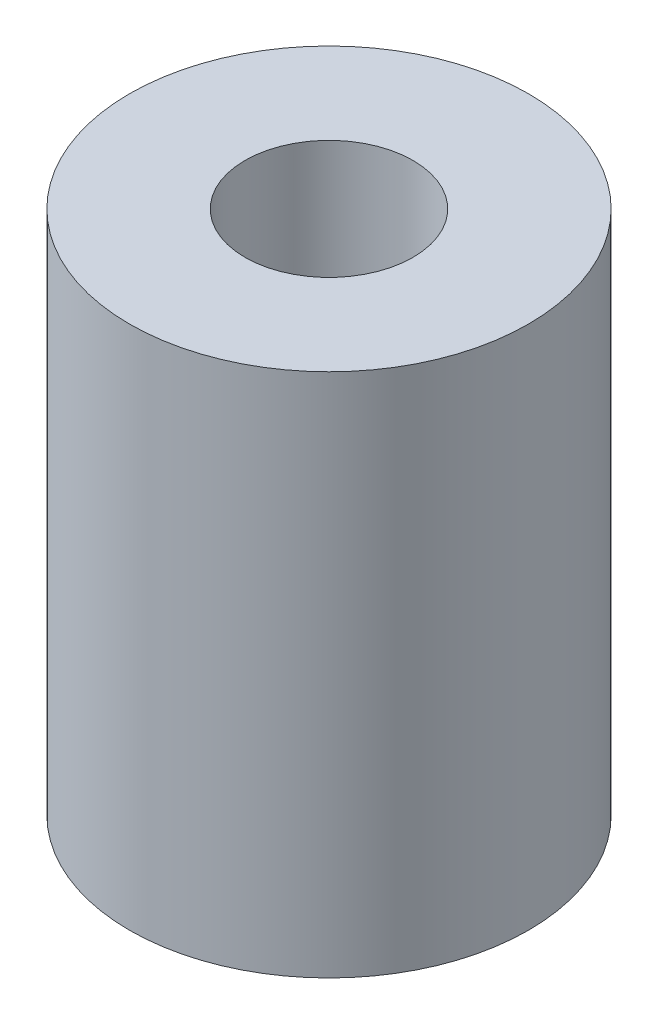
ISO-10303-21;
HEADER;
FILE_DESCRIPTION(('STEP AP214'),'2;1');
FILE_NAME('part.step','',(''),(''),'','','');
FILE_SCHEMA(('AUTOMOTIVE_DESIGN { 1 0 10303 214 1 1 1 1 }'));
ENDSEC;
DATA;
#1=APPLICATION_CONTEXT('core data for automotive mechanical design processes');
#2=APPLICATION_PROTOCOL_DEFINITION('international standard','automotive_design',2000,#1);
#3=PRODUCT_CONTEXT('',#1,'mechanical');
#4=PRODUCT('Part','Part','',(#3));
#5=PRODUCT_RELATED_PRODUCT_CATEGORY('part','',(#4));
#6=PRODUCT_DEFINITION_FORMATION('','',#4);
#7=PRODUCT_DEFINITION_CONTEXT('part definition',#1,'design');
#8=PRODUCT_DEFINITION('design','',#6,#7);
#9=PRODUCT_DEFINITION_SHAPE('','',#8);
#10=(LENGTH_UNIT() NAMED_UNIT(*) SI_UNIT(.MILLI.,.METRE.));
#11=(NAMED_UNIT(*) PLANE_ANGLE_UNIT() SI_UNIT($,.RADIAN.));
#12=(NAMED_UNIT(*) SI_UNIT($,.STERADIAN.) SOLID_ANGLE_UNIT());
#13=UNCERTAINTY_MEASURE_WITH_UNIT(LENGTH_MEASURE(1.E-05),#10,'distance_accuracy_value','');
#14=(GEOMETRIC_REPRESENTATION_CONTEXT(3) GLOBAL_UNCERTAINTY_ASSIGNED_CONTEXT((#13)) GLOBAL_UNIT_ASSIGNED_CONTEXT((#10,
#11,#12)) REPRESENTATION_CONTEXT('',''));
#15=CARTESIAN_POINT('',(0.,0.,0.));
#16=DIRECTION('',(0.,0.,1.));
#17=DIRECTION('',(1.,0.,0.));
#18=AXIS2_PLACEMENT_3D('',#15,#16,#17);
#19=CARTESIAN_POINT('',(0.,25.,0.));
#20=DIRECTION('',(0.,-1.,0.));
#21=DIRECTION('',(0.,0.,-1.));
#22=AXIS2_PLACEMENT_3D('',#19,#20,#21);
#23=CYLINDRICAL_SURFACE('',#22,9.5);
#24=CARTESIAN_POINT('',(0.,25.,0.));
#25=DIRECTION('',(0.,1.,0.));
#26=DIRECTION('',(0.,0.,1.));
#27=AXIS2_PLACEMENT_3D('',#24,#25,#26);
#28=CIRCLE('',#27,9.5);
#29=CARTESIAN_POINT('',(0.,25.,9.5));
#30=VERTEX_POINT('',#29);
#31=EDGE_CURVE('E10',#30,#30,#28,.T.);
#32=ORIENTED_EDGE('',*,*,#31,.F.);
#33=EDGE_LOOP('',(#32));
#34=FACE_BOUND('',#33,.T.);
#35=CARTESIAN_POINT('',(0.,0.,0.));
#36=DIRECTION('',(0.,1.,0.));
#37=DIRECTION('',(0.,0.,1.));
#38=AXIS2_PLACEMENT_3D('',#35,#36,#37);
#39=CIRCLE('',#38,9.5);
#40=CARTESIAN_POINT('',(0.,0.,9.5));
#41=VERTEX_POINT('',#40);
#42=EDGE_CURVE('E34',#41,#41,#39,.T.);
#43=ORIENTED_EDGE('',*,*,#42,.T.);
#44=EDGE_LOOP('',(#43));
#45=FACE_BOUND('',#44,.T.);
#46=ADVANCED_FACE('F31',(#34,#45),#23,.T.);
#47=CARTESIAN_POINT('',(0.,25.,0.));
#48=DIRECTION('',(0.,1.,0.));
#49=DIRECTION('',(0.,0.,1.));
#50=AXIS2_PLACEMENT_3D('',#47,#48,#49);
#51=PLANE('',#50);
#52=CARTESIAN_POINT('',(0.,25.,0.));
#53=DIRECTION('',(0.,1.,0.));
#54=DIRECTION('',(0.,0.,1.));
#55=AXIS2_PLACEMENT_3D('',#52,#53,#54);
#56=CIRCLE('',#55,4.);
#57=CARTESIAN_POINT('',(0.,25.,4.));
#58=VERTEX_POINT('',#57);
#59=EDGE_CURVE('E43',#58,#58,#56,.T.);
#60=ORIENTED_EDGE('',*,*,#59,.F.);
#61=EDGE_LOOP('',(#60));
#62=FACE_BOUND('',#61,.T.);
#63=ORIENTED_EDGE('',*,*,#31,.T.);
#64=EDGE_LOOP('',(#63));
#65=FACE_BOUND('',#64,.T.);
#66=ADVANCED_FACE('F68',(#62,#65),#51,.T.);
#67=CARTESIAN_POINT('',(0.,0.,0.));
#68=DIRECTION('',(0.,1.,0.));
#69=DIRECTION('',(0.,0.,1.));
#70=AXIS2_PLACEMENT_3D('',#67,#68,#69);
#71=PLANE('',#70);
#72=CARTESIAN_POINT('',(0.,0.,0.));
#73=DIRECTION('',(0.,-1.,0.));
#74=DIRECTION('',(0.,0.,-1.));
#75=AXIS2_PLACEMENT_3D('',#72,#73,#74);
#76=CIRCLE('',#75,2.5);
#77=CARTESIAN_POINT('',(0.,0.,-2.5));
#78=VERTEX_POINT('',#77);
#79=EDGE_CURVE('E49',#78,#78,#76,.T.);
#80=ORIENTED_EDGE('',*,*,#79,.F.);
#81=EDGE_LOOP('',(#80));
#82=FACE_BOUND('',#81,.T.);
#83=ORIENTED_EDGE('',*,*,#42,.F.);
#84=EDGE_LOOP('',(#83));
#85=FACE_BOUND('',#84,.T.);
#86=ADVANCED_FACE('F64',(#82,#85),#71,.F.);
#87=CARTESIAN_POINT('',(0.,8.,0.));
#88=DIRECTION('',(0.,1.,0.));
#89=DIRECTION('',(0.,0.,1.));
#90=AXIS2_PLACEMENT_3D('',#87,#88,#89);
#91=CYLINDRICAL_SURFACE('',#90,4.);
#92=CARTESIAN_POINT('',(0.,8.,0.));
#93=DIRECTION('',(0.,1.,0.));
#94=DIRECTION('',(0.,0.,1.));
#95=AXIS2_PLACEMENT_3D('',#92,#93,#94);
#96=CIRCLE('',#95,4.);
#97=CARTESIAN_POINT('',(0.,8.,4.));
#98=VERTEX_POINT('',#97);
#99=EDGE_CURVE('E41',#98,#98,#96,.T.);
#100=ORIENTED_EDGE('',*,*,#99,.F.);
#101=EDGE_LOOP('',(#100));
#102=FACE_BOUND('',#101,.T.);
#103=ORIENTED_EDGE('',*,*,#59,.T.);
#104=EDGE_LOOP('',(#103));
#105=FACE_BOUND('',#104,.T.);
#106=ADVANCED_FACE('F67',(#102,#105),#91,.F.);
#107=CARTESIAN_POINT('',(0.,8.,0.));
#108=DIRECTION('',(0.,1.,0.));
#109=DIRECTION('',(0.,0.,1.));
#110=AXIS2_PLACEMENT_3D('',#107,#108,#109);
#111=PLANE('',#110);
#112=CARTESIAN_POINT('',(0.,8.,0.));
#113=DIRECTION('',(0.,-1.,0.));
#114=DIRECTION('',(0.,0.,-1.));
#115=AXIS2_PLACEMENT_3D('',#112,#113,#114);
#116=CIRCLE('',#115,2.5);
#117=CARTESIAN_POINT('',(0.,8.,-2.5));
#118=VERTEX_POINT('',#117);
#119=EDGE_CURVE('E46',#118,#118,#116,.T.);
#120=ORIENTED_EDGE('',*,*,#119,.T.);
#121=EDGE_LOOP('',(#120));
#122=FACE_BOUND('',#121,.T.);
#123=ORIENTED_EDGE('',*,*,#99,.T.);
#124=EDGE_LOOP('',(#123));
#125=FACE_BOUND('',#124,.T.);
#126=ADVANCED_FACE('F55',(#122,#125),#111,.T.);
#127=CARTESIAN_POINT('',(0.,8.,0.));
#128=DIRECTION('',(0.,-1.,0.));
#129=DIRECTION('',(0.,0.,-1.));
#130=AXIS2_PLACEMENT_3D('',#127,#128,#129);
#131=CYLINDRICAL_SURFACE('',#130,2.5);
#132=ORIENTED_EDGE('',*,*,#119,.F.);
#133=EDGE_LOOP('',(#132));
#134=FACE_BOUND('',#133,.T.);
#135=ORIENTED_EDGE('',*,*,#79,.T.);
#136=EDGE_LOOP('',(#135));
#137=FACE_BOUND('',#136,.T.);
#138=ADVANCED_FACE('F58',(#134,#137),#131,.F.);
#139=CLOSED_SHELL('',(#46,#66,#86,#106,#126,#138));
#140=MANIFOLD_SOLID_BREP('B2',#139);
#141=ADVANCED_BREP_SHAPE_REPRESENTATION('',(#18,#140),#14);
#142=SHAPE_DEFINITION_REPRESENTATION(#9,#141);
ENDSEC;
END-ISO-10303-21;
